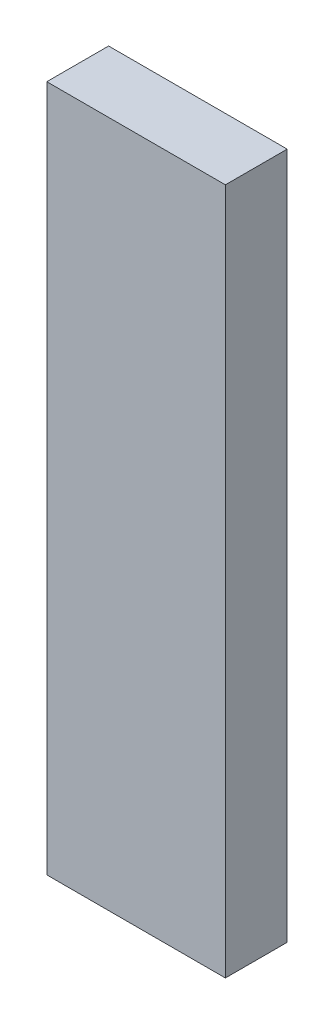
ISO-10303-21;
HEADER;
FILE_DESCRIPTION(('STEP AP214'),'2;1');
FILE_NAME('part.step','',(''),(''),'','','');
FILE_SCHEMA(('AUTOMOTIVE_DESIGN { 1 0 10303 214 1 1 1 1 }'));
ENDSEC;
DATA;
#1=APPLICATION_CONTEXT('core data for automotive mechanical design processes');
#2=APPLICATION_PROTOCOL_DEFINITION('international standard','automotive_design',2000,#1);
#3=PRODUCT_CONTEXT('',#1,'mechanical');
#4=PRODUCT('Part','Part','',(#3));
#5=PRODUCT_RELATED_PRODUCT_CATEGORY('part','',(#4));
#6=PRODUCT_DEFINITION_FORMATION('','',#4);
#7=PRODUCT_DEFINITION_CONTEXT('part definition',#1,'design');
#8=PRODUCT_DEFINITION('design','',#6,#7);
#9=PRODUCT_DEFINITION_SHAPE('','',#8);
#10=(LENGTH_UNIT() NAMED_UNIT(*) SI_UNIT(.MILLI.,.METRE.));
#11=(NAMED_UNIT(*) PLANE_ANGLE_UNIT() SI_UNIT($,.RADIAN.));
#12=(NAMED_UNIT(*) SI_UNIT($,.STERADIAN.) SOLID_ANGLE_UNIT());
#13=UNCERTAINTY_MEASURE_WITH_UNIT(LENGTH_MEASURE(1.E-05),#10,'distance_accuracy_value','');
#14=(GEOMETRIC_REPRESENTATION_CONTEXT(3) GLOBAL_UNCERTAINTY_ASSIGNED_CONTEXT((#13)) GLOBAL_UNIT_ASSIGNED_CONTEXT((#10,
#11,#12)) REPRESENTATION_CONTEXT('',''));
#15=CARTESIAN_POINT('',(0.,0.,0.));
#16=DIRECTION('',(0.,0.,1.));
#17=DIRECTION('',(1.,0.,0.));
#18=AXIS2_PLACEMENT_3D('',#15,#16,#17);
#19=CARTESIAN_POINT('',(0.65000124,-2.50000008,0.4499991));
#20=DIRECTION('',(0.,0.,-1.));
#21=DIRECTION('',(-1.,0.,0.));
#22=AXIS2_PLACEMENT_3D('',#19,#20,#21);
#23=PLANE('',#22);
#24=DIRECTION('',(1.,0.,0.));
#25=VECTOR('',#24,1.);
#26=CARTESIAN_POINT('',(0.65000124,2.50000008,0.4499991));
#27=LINE('',#26,#25);
#28=CARTESIAN_POINT('',(0.65000124,2.50000008,0.4499991));
#29=VERTEX_POINT('',#28);
#30=CARTESIAN_POINT('',(-0.6499987,2.50000008,0.4499991));
#31=VERTEX_POINT('',#30);
#32=EDGE_CURVE('E54',#29,#31,#27,.F.);
#33=ORIENTED_EDGE('',*,*,#32,.T.);
#34=DIRECTION('',(0.,1.,0.));
#35=VECTOR('',#34,1.);
#36=CARTESIAN_POINT('',(-0.6499987,2.50000008,0.4499991));
#37=LINE('',#36,#35);
#38=CARTESIAN_POINT('',(-0.6499987,-2.50000008,0.4499991));
#39=VERTEX_POINT('',#38);
#40=EDGE_CURVE('E56',#31,#39,#37,.F.);
#41=ORIENTED_EDGE('',*,*,#40,.T.);
#42=DIRECTION('',(1.,0.,0.));
#43=VECTOR('',#42,1.);
#44=CARTESIAN_POINT('',(-0.6499987,-2.50000008,0.4499991));
#45=LINE('',#44,#43);
#46=CARTESIAN_POINT('',(0.65000124,-2.50000008,0.4499991));
#47=VERTEX_POINT('',#46);
#48=EDGE_CURVE('E19',#39,#47,#45,.T.);
#49=ORIENTED_EDGE('',*,*,#48,.T.);
#50=DIRECTION('',(0.,1.,0.));
#51=VECTOR('',#50,1.);
#52=CARTESIAN_POINT('',(0.65000124,-2.50000008,0.4499991));
#53=LINE('',#52,#51);
#54=EDGE_CURVE('E79',#47,#29,#53,.T.);
#55=ORIENTED_EDGE('',*,*,#54,.T.);
#56=EDGE_LOOP('',(#33,#41,#49,#55));
#57=FACE_BOUND('',#56,.T.);
#58=ADVANCED_FACE('F16',(#57),#23,.F.);
#59=CARTESIAN_POINT('',(-0.6499987,-2.50000008,0.));
#60=DIRECTION('',(0.,1.,0.));
#61=DIRECTION('',(0.,0.,1.));
#62=AXIS2_PLACEMENT_3D('',#59,#60,#61);
#63=PLANE('',#62);
#64=DIRECTION('',(0.,0.,1.));
#65=VECTOR('',#64,1.);
#66=CARTESIAN_POINT('',(0.65000124,-2.50000008,0.));
#67=LINE('',#66,#65);
#68=CARTESIAN_POINT('',(0.65000124,-2.50000008,0.));
#69=VERTEX_POINT('',#68);
#70=EDGE_CURVE('E67',#69,#47,#67,.T.);
#71=ORIENTED_EDGE('',*,*,#70,.T.);
#72=ORIENTED_EDGE('',*,*,#48,.F.);
#73=DIRECTION('',(0.,0.,-1.));
#74=VECTOR('',#73,1.);
#75=CARTESIAN_POINT('',(-0.6499987,-2.50000008,0.));
#76=LINE('',#75,#74);
#77=CARTESIAN_POINT('',(-0.6499987,-2.50000008,0.));
#78=VERTEX_POINT('',#77);
#79=EDGE_CURVE('E62',#39,#78,#76,.T.);
#80=ORIENTED_EDGE('',*,*,#79,.T.);
#81=DIRECTION('',(-1.,0.,0.));
#82=VECTOR('',#81,1.);
#83=CARTESIAN_POINT('',(0.65000124,-2.50000008,0.));
#84=LINE('',#83,#82);
#85=EDGE_CURVE('E82',#69,#78,#84,.T.);
#86=ORIENTED_EDGE('',*,*,#85,.F.);
#87=EDGE_LOOP('',(#71,#72,#80,#86));
#88=FACE_BOUND('',#87,.T.);
#89=ADVANCED_FACE('F64',(#88),#63,.F.);
#90=CARTESIAN_POINT('',(-0.6499987,2.50000008,0.));
#91=DIRECTION('',(1.,0.,0.));
#92=DIRECTION('',(0.,0.,-1.));
#93=AXIS2_PLACEMENT_3D('',#90,#91,#92);
#94=PLANE('',#93);
#95=ORIENTED_EDGE('',*,*,#79,.F.);
#96=ORIENTED_EDGE('',*,*,#40,.F.);
#97=DIRECTION('',(0.,0.,-1.));
#98=VECTOR('',#97,1.);
#99=CARTESIAN_POINT('',(-0.6499987,2.50000008,0.));
#100=LINE('',#99,#98);
#101=CARTESIAN_POINT('',(-0.6499987,2.50000008,0.));
#102=VERTEX_POINT('',#101);
#103=EDGE_CURVE('E74',#31,#102,#100,.T.);
#104=ORIENTED_EDGE('',*,*,#103,.T.);
#105=DIRECTION('',(0.,1.,0.));
#106=VECTOR('',#105,1.);
#107=CARTESIAN_POINT('',(-0.6499987,-2.50000008,0.));
#108=LINE('',#107,#106);
#109=EDGE_CURVE('E71',#78,#102,#108,.T.);
#110=ORIENTED_EDGE('',*,*,#109,.F.);
#111=EDGE_LOOP('',(#95,#96,#104,#110));
#112=FACE_BOUND('',#111,.T.);
#113=ADVANCED_FACE('F69',(#112),#94,.F.);
#114=CARTESIAN_POINT('',(0.65000124,2.50000008,0.));
#115=DIRECTION('',(0.,-1.,0.));
#116=DIRECTION('',(0.,0.,-1.));
#117=AXIS2_PLACEMENT_3D('',#114,#115,#116);
#118=PLANE('',#117);
#119=ORIENTED_EDGE('',*,*,#103,.F.);
#120=ORIENTED_EDGE('',*,*,#32,.F.);
#121=DIRECTION('',(0.,0.,1.));
#122=VECTOR('',#121,1.);
#123=CARTESIAN_POINT('',(0.65000124,2.50000008,0.));
#124=LINE('',#123,#122);
#125=CARTESIAN_POINT('',(0.65000124,2.50000008,0.));
#126=VERTEX_POINT('',#125);
#127=EDGE_CURVE('E34',#29,#126,#124,.F.);
#128=ORIENTED_EDGE('',*,*,#127,.T.);
#129=DIRECTION('',(-1.,0.,0.));
#130=VECTOR('',#129,1.);
#131=CARTESIAN_POINT('',(0.65000124,2.50000008,0.));
#132=LINE('',#131,#130);
#133=EDGE_CURVE('E25',#102,#126,#132,.F.);
#134=ORIENTED_EDGE('',*,*,#133,.F.);
#135=EDGE_LOOP('',(#119,#120,#128,#134));
#136=FACE_BOUND('',#135,.T.);
#137=ADVANCED_FACE('F88',(#136),#118,.F.);
#138=CARTESIAN_POINT('',(0.65000124,-2.50000008,0.));
#139=DIRECTION('',(-1.,0.,0.));
#140=DIRECTION('',(0.,0.,1.));
#141=AXIS2_PLACEMENT_3D('',#138,#139,#140);
#142=PLANE('',#141);
#143=ORIENTED_EDGE('',*,*,#127,.F.);
#144=ORIENTED_EDGE('',*,*,#54,.F.);
#145=ORIENTED_EDGE('',*,*,#70,.F.);
#146=DIRECTION('',(0.,1.,0.));
#147=VECTOR('',#146,1.);
#148=CARTESIAN_POINT('',(0.65000124,-2.50000008,0.));
#149=LINE('',#148,#147);
#150=EDGE_CURVE('E10',#126,#69,#149,.F.);
#151=ORIENTED_EDGE('',*,*,#150,.F.);
#152=EDGE_LOOP('',(#143,#144,#145,#151));
#153=FACE_BOUND('',#152,.T.);
#154=ADVANCED_FACE('F90',(#153),#142,.F.);
#155=CARTESIAN_POINT('',(0.65000124,-2.50000008,0.));
#156=DIRECTION('',(0.,0.,-1.));
#157=DIRECTION('',(-1.,0.,0.));
#158=AXIS2_PLACEMENT_3D('',#155,#156,#157);
#159=PLANE('',#158);
#160=ORIENTED_EDGE('',*,*,#133,.T.);
#161=ORIENTED_EDGE('',*,*,#150,.T.);
#162=ORIENTED_EDGE('',*,*,#85,.T.);
#163=ORIENTED_EDGE('',*,*,#109,.T.);
#164=EDGE_LOOP('',(#160,#161,#162,#163));
#165=FACE_BOUND('',#164,.T.);
#166=ADVANCED_FACE('F87',(#165),#159,.T.);
#167=CLOSED_SHELL('',(#58,#89,#113,#137,#154,#166));
#168=MANIFOLD_SOLID_BREP('B1',#167);
#169=ADVANCED_BREP_SHAPE_REPRESENTATION('',(#18,#168),#14);
#170=SHAPE_DEFINITION_REPRESENTATION(#9,#169);
ENDSEC;
END-ISO-10303-21;
